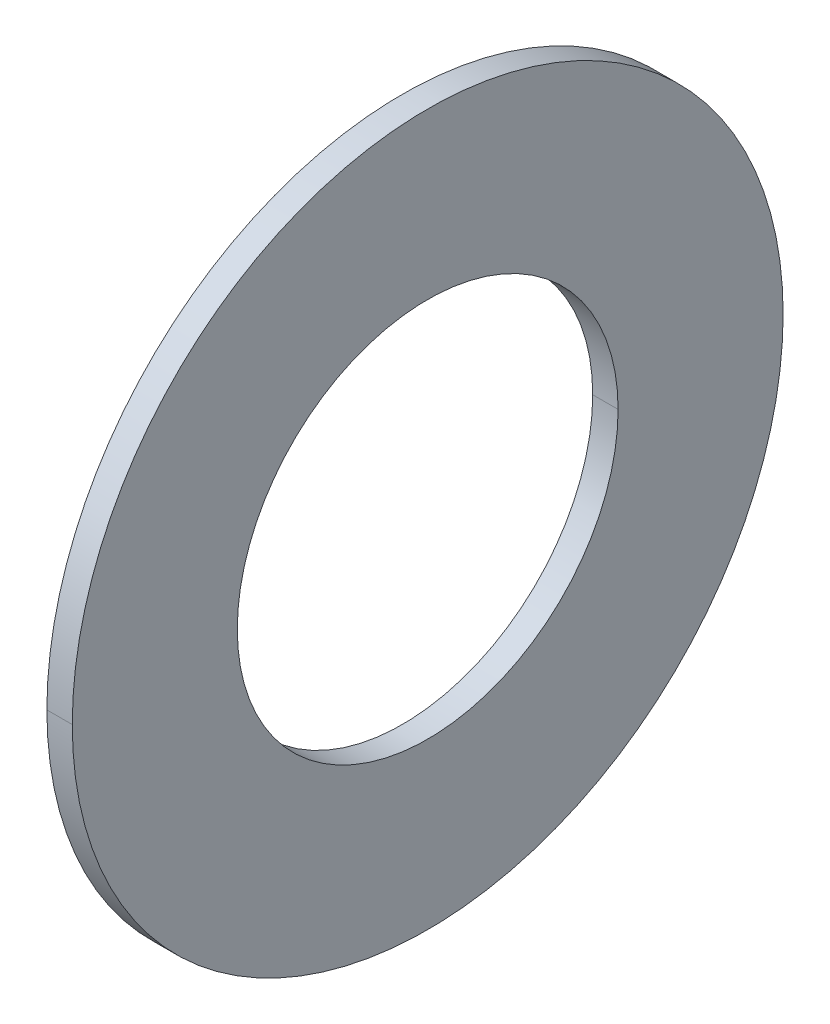
ISO-10303-21;
HEADER;
FILE_DESCRIPTION(('STEP AP214'),'2;1');
FILE_NAME('part.step','',(''),(''),'','','');
FILE_SCHEMA(('AUTOMOTIVE_DESIGN { 1 0 10303 214 1 1 1 1 }'));
ENDSEC;
DATA;
#1=APPLICATION_CONTEXT('core data for automotive mechanical design processes');
#2=APPLICATION_PROTOCOL_DEFINITION('international standard','automotive_design',2000,#1);
#3=PRODUCT_CONTEXT('',#1,'mechanical');
#4=PRODUCT('Part','Part','',(#3));
#5=PRODUCT_RELATED_PRODUCT_CATEGORY('part','',(#4));
#6=PRODUCT_DEFINITION_FORMATION('','',#4);
#7=PRODUCT_DEFINITION_CONTEXT('part definition',#1,'design');
#8=PRODUCT_DEFINITION('design','',#6,#7);
#9=PRODUCT_DEFINITION_SHAPE('','',#8);
#10=(LENGTH_UNIT() NAMED_UNIT(*) SI_UNIT(.MILLI.,.METRE.));
#11=(NAMED_UNIT(*) PLANE_ANGLE_UNIT() SI_UNIT($,.RADIAN.));
#12=(NAMED_UNIT(*) SI_UNIT($,.STERADIAN.) SOLID_ANGLE_UNIT());
#13=UNCERTAINTY_MEASURE_WITH_UNIT(LENGTH_MEASURE(1.E-05),#10,'distance_accuracy_value','');
#14=(GEOMETRIC_REPRESENTATION_CONTEXT(3) GLOBAL_UNCERTAINTY_ASSIGNED_CONTEXT((#13)) GLOBAL_UNIT_ASSIGNED_CONTEXT((#10,
#11,#12)) REPRESENTATION_CONTEXT('',''));
#15=CARTESIAN_POINT('',(0.,0.,0.));
#16=DIRECTION('',(0.,0.,1.));
#17=DIRECTION('',(1.,0.,0.));
#18=AXIS2_PLACEMENT_3D('',#15,#16,#17);
#19=CARTESIAN_POINT('',(1.,14.,0.));
#20=DIRECTION('',(-1.,0.,0.));
#21=DIRECTION('',(0.,0.,1.));
#22=AXIS2_PLACEMENT_3D('',#19,#20,#21);
#23=PLANE('',#22);
#24=CARTESIAN_POINT('',(1.,0.,0.));
#25=DIRECTION('',(1.,0.,0.));
#26=DIRECTION('',(0.,0.,-1.));
#27=AXIS2_PLACEMENT_3D('',#24,#25,#26);
#28=CIRCLE('',#27,7.5);
#29=CARTESIAN_POINT('',(1.,0.,-7.5));
#30=VERTEX_POINT('',#29);
#31=CARTESIAN_POINT('',(1.,0.,7.5));
#32=VERTEX_POINT('',#31);
#33=EDGE_CURVE('E11',#30,#32,#28,.T.);
#34=ORIENTED_EDGE('',*,*,#33,.T.);
#35=CARTESIAN_POINT('',(1.,0.,0.));
#36=DIRECTION('',(1.,0.,0.));
#37=DIRECTION('',(0.,0.,-1.));
#38=AXIS2_PLACEMENT_3D('',#35,#36,#37);
#39=CIRCLE('',#38,7.5);
#40=EDGE_CURVE('E25',#32,#30,#39,.T.);
#41=ORIENTED_EDGE('',*,*,#40,.T.);
#42=EDGE_LOOP('',(#34,#41));
#43=FACE_BOUND('',#42,.T.);
#44=CARTESIAN_POINT('',(1.,0.,0.));
#45=DIRECTION('',(1.,0.,0.));
#46=DIRECTION('',(0.,0.,-1.));
#47=AXIS2_PLACEMENT_3D('',#44,#45,#46);
#48=CIRCLE('',#47,14.);
#49=CARTESIAN_POINT('',(1.,0.,14.));
#50=VERTEX_POINT('',#49);
#51=CARTESIAN_POINT('',(1.,0.,-14.));
#52=VERTEX_POINT('',#51);
#53=EDGE_CURVE('E102',#50,#52,#48,.T.);
#54=ORIENTED_EDGE('',*,*,#53,.F.);
#55=CARTESIAN_POINT('',(1.,0.,0.));
#56=DIRECTION('',(1.,0.,0.));
#57=DIRECTION('',(0.,0.,-1.));
#58=AXIS2_PLACEMENT_3D('',#55,#56,#57);
#59=CIRCLE('',#58,14.);
#60=EDGE_CURVE('E96',#52,#50,#59,.T.);
#61=ORIENTED_EDGE('',*,*,#60,.F.);
#62=EDGE_LOOP('',(#54,#61));
#63=FACE_BOUND('',#62,.T.);
#64=ADVANCED_FACE('F16',(#43,#63),#23,.T.);
#65=CARTESIAN_POINT('',(50.,0.,0.));
#66=DIRECTION('',(1.,0.,0.));
#67=DIRECTION('',(0.,-1.,0.));
#68=AXIS2_PLACEMENT_3D('',#65,#66,#67);
#69=CYLINDRICAL_SURFACE('',#68,14.);
#70=DIRECTION('',(1.,0.,0.));
#71=VECTOR('',#70,1.);
#72=CARTESIAN_POINT('',(1.,0.,14.));
#73=LINE('',#72,#71);
#74=CARTESIAN_POINT('',(2.,0.,14.));
#75=VERTEX_POINT('',#74);
#76=EDGE_CURVE('E92',#50,#75,#73,.T.);
#77=ORIENTED_EDGE('',*,*,#76,.T.);
#78=CARTESIAN_POINT('',(2.,0.,0.));
#79=DIRECTION('',(1.,0.,0.));
#80=DIRECTION('',(0.,0.,-1.));
#81=AXIS2_PLACEMENT_3D('',#78,#79,#80);
#82=CIRCLE('',#81,14.);
#83=CARTESIAN_POINT('',(2.,0.,-14.));
#84=VERTEX_POINT('',#83);
#85=EDGE_CURVE('E86',#84,#75,#82,.T.);
#86=ORIENTED_EDGE('',*,*,#85,.F.);
#87=DIRECTION('',(1.,0.,0.));
#88=VECTOR('',#87,1.);
#89=CARTESIAN_POINT('',(1.,0.,-14.));
#90=LINE('',#89,#88);
#91=EDGE_CURVE('E75',#52,#84,#90,.T.);
#92=ORIENTED_EDGE('',*,*,#91,.F.);
#93=ORIENTED_EDGE('',*,*,#60,.T.);
#94=EDGE_LOOP('',(#77,#86,#92,#93));
#95=FACE_BOUND('',#94,.T.);
#96=ADVANCED_FACE('F123',(#95),#69,.T.);
#97=CARTESIAN_POINT('',(50.,0.,0.));
#98=DIRECTION('',(1.,0.,0.));
#99=DIRECTION('',(0.,1.,0.));
#100=AXIS2_PLACEMENT_3D('',#97,#98,#99);
#101=CYLINDRICAL_SURFACE('',#100,14.);
#102=ORIENTED_EDGE('',*,*,#76,.F.);
#103=ORIENTED_EDGE('',*,*,#53,.T.);
#104=ORIENTED_EDGE('',*,*,#91,.T.);
#105=CARTESIAN_POINT('',(2.,0.,0.));
#106=DIRECTION('',(1.,0.,0.));
#107=DIRECTION('',(0.,0.,-1.));
#108=AXIS2_PLACEMENT_3D('',#105,#106,#107);
#109=CIRCLE('',#108,14.);
#110=EDGE_CURVE('E71',#75,#84,#109,.T.);
#111=ORIENTED_EDGE('',*,*,#110,.F.);
#112=EDGE_LOOP('',(#102,#103,#104,#111));
#113=FACE_BOUND('',#112,.T.);
#114=ADVANCED_FACE('F118',(#113),#101,.T.);
#115=CARTESIAN_POINT('',(2.,7.5,0.));
#116=DIRECTION('',(1.,0.,0.));
#117=DIRECTION('',(0.,0.,-1.));
#118=AXIS2_PLACEMENT_3D('',#115,#116,#117);
#119=PLANE('',#118);
#120=ORIENTED_EDGE('',*,*,#85,.T.);
#121=ORIENTED_EDGE('',*,*,#110,.T.);
#122=EDGE_LOOP('',(#120,#121));
#123=FACE_BOUND('',#122,.T.);
#124=CARTESIAN_POINT('',(2.,0.,0.));
#125=DIRECTION('',(1.,0.,0.));
#126=DIRECTION('',(0.,0.,-1.));
#127=AXIS2_PLACEMENT_3D('',#124,#125,#126);
#128=CIRCLE('',#127,7.5);
#129=CARTESIAN_POINT('',(2.,0.,7.5));
#130=VERTEX_POINT('',#129);
#131=CARTESIAN_POINT('',(2.,0.,-7.5));
#132=VERTEX_POINT('',#131);
#133=EDGE_CURVE('E57',#130,#132,#128,.T.);
#134=ORIENTED_EDGE('',*,*,#133,.F.);
#135=CARTESIAN_POINT('',(2.,0.,0.));
#136=DIRECTION('',(1.,0.,0.));
#137=DIRECTION('',(0.,0.,-1.));
#138=AXIS2_PLACEMENT_3D('',#135,#136,#137);
#139=CIRCLE('',#138,7.5);
#140=EDGE_CURVE('E53',#132,#130,#139,.T.);
#141=ORIENTED_EDGE('',*,*,#140,.F.);
#142=EDGE_LOOP('',(#134,#141));
#143=FACE_BOUND('',#142,.T.);
#144=ADVANCED_FACE('F55',(#123,#143),#119,.T.);
#145=CARTESIAN_POINT('',(50.,0.,0.));
#146=DIRECTION('',(1.,0.,0.));
#147=DIRECTION('',(0.,-1.,0.));
#148=AXIS2_PLACEMENT_3D('',#145,#146,#147);
#149=CYLINDRICAL_SURFACE('',#148,7.5);
#150=DIRECTION('',(1.,0.,0.));
#151=VECTOR('',#150,1.);
#152=CARTESIAN_POINT('',(1.,0.,7.5));
#153=LINE('',#152,#151);
#154=EDGE_CURVE('E62',#32,#130,#153,.T.);
#155=ORIENTED_EDGE('',*,*,#154,.F.);
#156=ORIENTED_EDGE('',*,*,#33,.F.);
#157=DIRECTION('',(1.,0.,0.));
#158=VECTOR('',#157,1.);
#159=CARTESIAN_POINT('',(1.,0.,-7.5));
#160=LINE('',#159,#158);
#161=EDGE_CURVE('E65',#30,#132,#160,.T.);
#162=ORIENTED_EDGE('',*,*,#161,.T.);
#163=ORIENTED_EDGE('',*,*,#140,.T.);
#164=EDGE_LOOP('',(#155,#156,#162,#163));
#165=FACE_BOUND('',#164,.T.);
#166=ADVANCED_FACE('F66',(#165),#149,.F.);
#167=CARTESIAN_POINT('',(50.,0.,0.));
#168=DIRECTION('',(1.,0.,0.));
#169=DIRECTION('',(0.,1.,0.));
#170=AXIS2_PLACEMENT_3D('',#167,#168,#169);
#171=CYLINDRICAL_SURFACE('',#170,7.5);
#172=ORIENTED_EDGE('',*,*,#154,.T.);
#173=ORIENTED_EDGE('',*,*,#133,.T.);
#174=ORIENTED_EDGE('',*,*,#161,.F.);
#175=ORIENTED_EDGE('',*,*,#40,.F.);
#176=EDGE_LOOP('',(#172,#173,#174,#175));
#177=FACE_BOUND('',#176,.T.);
#178=ADVANCED_FACE('F70',(#177),#171,.F.);
#179=CLOSED_SHELL('',(#64,#96,#114,#144,#166,#178));
#180=MANIFOLD_SOLID_BREP('B1',#179);
#181=ADVANCED_BREP_SHAPE_REPRESENTATION('',(#18,#180),#14);
#182=SHAPE_DEFINITION_REPRESENTATION(#9,#181);
ENDSEC;
END-ISO-10303-21;
